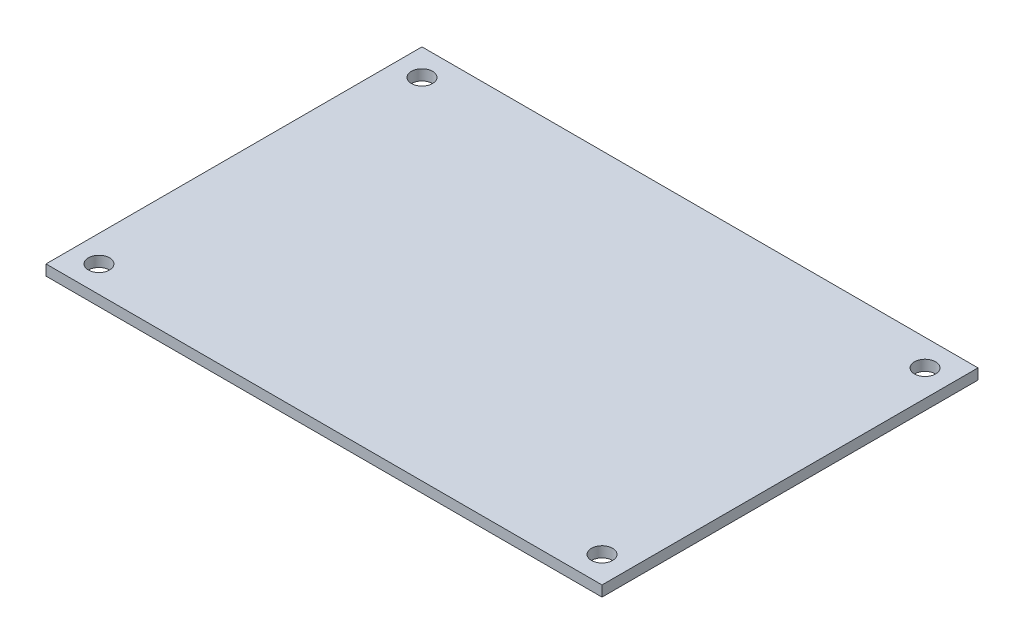
ISO-10303-21;
HEADER;
FILE_DESCRIPTION(('STEP AP214'),'2;1');
FILE_NAME('part.step','',(''),(''),'','','');
FILE_SCHEMA(('AUTOMOTIVE_DESIGN { 1 0 10303 214 1 1 1 1 }'));
ENDSEC;
DATA;
#1=APPLICATION_CONTEXT('core data for automotive mechanical design processes');
#2=APPLICATION_PROTOCOL_DEFINITION('international standard','automotive_design',2000,#1);
#3=PRODUCT_CONTEXT('',#1,'mechanical');
#4=PRODUCT('Part','Part','',(#3));
#5=PRODUCT_RELATED_PRODUCT_CATEGORY('part','',(#4));
#6=PRODUCT_DEFINITION_FORMATION('','',#4);
#7=PRODUCT_DEFINITION_CONTEXT('part definition',#1,'design');
#8=PRODUCT_DEFINITION('design','',#6,#7);
#9=PRODUCT_DEFINITION_SHAPE('','',#8);
#10=(LENGTH_UNIT() NAMED_UNIT(*) SI_UNIT(.MILLI.,.METRE.));
#11=(NAMED_UNIT(*) PLANE_ANGLE_UNIT() SI_UNIT($,.RADIAN.));
#12=(NAMED_UNIT(*) SI_UNIT($,.STERADIAN.) SOLID_ANGLE_UNIT());
#13=UNCERTAINTY_MEASURE_WITH_UNIT(LENGTH_MEASURE(1.E-05),#10,'distance_accuracy_value','');
#14=(GEOMETRIC_REPRESENTATION_CONTEXT(3) GLOBAL_UNCERTAINTY_ASSIGNED_CONTEXT((#13)) GLOBAL_UNIT_ASSIGNED_CONTEXT((#10,
#11,#12)) REPRESENTATION_CONTEXT('',''));
#15=CARTESIAN_POINT('',(0.,0.,0.));
#16=DIRECTION('',(0.,0.,1.));
#17=DIRECTION('',(1.,0.,0.));
#18=AXIS2_PLACEMENT_3D('',#15,#16,#17);
#19=CARTESIAN_POINT('',(0.,2.,0.));
#20=DIRECTION('',(0.,-1.,0.));
#21=DIRECTION('',(0.,0.,-1.));
#22=AXIS2_PLACEMENT_3D('',#19,#20,#21);
#23=PLANE('',#22);
#24=DIRECTION('',(0.,0.,-1.));
#25=VECTOR('',#24,1.);
#26=CARTESIAN_POINT('',(52.5,2.,35.5));
#27=LINE('',#26,#25);
#28=CARTESIAN_POINT('',(52.5,2.,35.5));
#29=VERTEX_POINT('',#28);
#30=CARTESIAN_POINT('',(52.5,2.,-35.5));
#31=VERTEX_POINT('',#30);
#32=EDGE_CURVE('E84',#29,#31,#27,.T.);
#33=ORIENTED_EDGE('',*,*,#32,.T.);
#34=DIRECTION('',(-1.,0.,0.));
#35=VECTOR('',#34,1.);
#36=CARTESIAN_POINT('',(-52.5,2.,-35.5));
#37=LINE('',#36,#35);
#38=CARTESIAN_POINT('',(-52.5,2.,-35.5));
#39=VERTEX_POINT('',#38);
#40=EDGE_CURVE('E79',#31,#39,#37,.T.);
#41=ORIENTED_EDGE('',*,*,#40,.T.);
#42=DIRECTION('',(0.,0.,1.));
#43=VECTOR('',#42,1.);
#44=CARTESIAN_POINT('',(-52.5,2.,35.5));
#45=LINE('',#44,#43);
#46=CARTESIAN_POINT('',(-52.5,2.,35.5));
#47=VERTEX_POINT('',#46);
#48=EDGE_CURVE('E82',#39,#47,#45,.T.);
#49=ORIENTED_EDGE('',*,*,#48,.T.);
#50=DIRECTION('',(1.,0.,0.));
#51=VECTOR('',#50,1.);
#52=CARTESIAN_POINT('',(-52.5,2.,35.5));
#53=LINE('',#52,#51);
#54=EDGE_CURVE('E49',#47,#29,#53,.T.);
#55=ORIENTED_EDGE('',*,*,#54,.T.);
#56=EDGE_LOOP('',(#33,#41,#49,#55));
#57=FACE_BOUND('',#56,.T.);
#58=CARTESIAN_POINT('',(-47.5,2.,-30.5));
#59=DIRECTION('',(0.,1.,0.));
#60=DIRECTION('',(0.,0.,1.));
#61=AXIS2_PLACEMENT_3D('',#58,#59,#60);
#62=CIRCLE('',#61,2.);
#63=CARTESIAN_POINT('',(-47.5,2.,-28.5));
#64=VERTEX_POINT('',#63);
#65=EDGE_CURVE('E99',#64,#64,#62,.T.);
#66=ORIENTED_EDGE('',*,*,#65,.F.);
#67=EDGE_LOOP('',(#66));
#68=FACE_BOUND('',#67,.T.);
#69=CARTESIAN_POINT('',(47.5,2.,-30.5));
#70=DIRECTION('',(0.,1.,0.));
#71=DIRECTION('',(0.,0.,1.));
#72=AXIS2_PLACEMENT_3D('',#69,#70,#71);
#73=CIRCLE('',#72,2.);
#74=CARTESIAN_POINT('',(47.5,2.,-28.5));
#75=VERTEX_POINT('',#74);
#76=EDGE_CURVE('E114',#75,#75,#73,.T.);
#77=ORIENTED_EDGE('',*,*,#76,.F.);
#78=EDGE_LOOP('',(#77));
#79=FACE_BOUND('',#78,.T.);
#80=CARTESIAN_POINT('',(47.5,2.,30.5));
#81=DIRECTION('',(0.,1.,0.));
#82=DIRECTION('',(0.,0.,1.));
#83=AXIS2_PLACEMENT_3D('',#80,#81,#82);
#84=CIRCLE('',#83,2.);
#85=CARTESIAN_POINT('',(47.5,2.,32.5));
#86=VERTEX_POINT('',#85);
#87=EDGE_CURVE('E120',#86,#86,#84,.T.);
#88=ORIENTED_EDGE('',*,*,#87,.F.);
#89=EDGE_LOOP('',(#88));
#90=FACE_BOUND('',#89,.T.);
#91=CARTESIAN_POINT('',(-47.5,2.,30.5));
#92=DIRECTION('',(0.,1.,0.));
#93=DIRECTION('',(0.,0.,1.));
#94=AXIS2_PLACEMENT_3D('',#91,#92,#93);
#95=CIRCLE('',#94,2.);
#96=CARTESIAN_POINT('',(-47.5,2.,32.5));
#97=VERTEX_POINT('',#96);
#98=EDGE_CURVE('E126',#97,#97,#95,.T.);
#99=ORIENTED_EDGE('',*,*,#98,.F.);
#100=EDGE_LOOP('',(#99));
#101=FACE_BOUND('',#100,.T.);
#102=ADVANCED_FACE('F32',(#57,#68,#79,#90,#101),#23,.F.);
#103=CARTESIAN_POINT('',(0.,0.,0.));
#104=DIRECTION('',(0.,-1.,0.));
#105=DIRECTION('',(0.,0.,-1.));
#106=AXIS2_PLACEMENT_3D('',#103,#104,#105);
#107=PLANE('',#106);
#108=CARTESIAN_POINT('',(47.5,0.,30.5));
#109=DIRECTION('',(0.,1.,0.));
#110=DIRECTION('',(0.,0.,1.));
#111=AXIS2_PLACEMENT_3D('',#108,#109,#110);
#112=CIRCLE('',#111,2.);
#113=CARTESIAN_POINT('',(47.5,0.,32.5));
#114=VERTEX_POINT('',#113);
#115=EDGE_CURVE('E123',#114,#114,#112,.T.);
#116=ORIENTED_EDGE('',*,*,#115,.T.);
#117=EDGE_LOOP('',(#116));
#118=FACE_BOUND('',#117,.T.);
#119=CARTESIAN_POINT('',(-47.5,0.,-30.5));
#120=DIRECTION('',(0.,1.,0.));
#121=DIRECTION('',(0.,0.,1.));
#122=AXIS2_PLACEMENT_3D('',#119,#120,#121);
#123=CIRCLE('',#122,2.);
#124=CARTESIAN_POINT('',(-47.5,0.,-28.5));
#125=VERTEX_POINT('',#124);
#126=EDGE_CURVE('E111',#125,#125,#123,.T.);
#127=ORIENTED_EDGE('',*,*,#126,.T.);
#128=EDGE_LOOP('',(#127));
#129=FACE_BOUND('',#128,.T.);
#130=DIRECTION('',(0.,0.,-1.));
#131=VECTOR('',#130,1.);
#132=CARTESIAN_POINT('',(52.5,0.,35.5));
#133=LINE('',#132,#131);
#134=CARTESIAN_POINT('',(52.5,0.,35.5));
#135=VERTEX_POINT('',#134);
#136=CARTESIAN_POINT('',(52.5,0.,-35.5));
#137=VERTEX_POINT('',#136);
#138=EDGE_CURVE('E96',#135,#137,#133,.T.);
#139=ORIENTED_EDGE('',*,*,#138,.F.);
#140=DIRECTION('',(1.,0.,0.));
#141=VECTOR('',#140,1.);
#142=CARTESIAN_POINT('',(-52.5,0.,35.5));
#143=LINE('',#142,#141);
#144=CARTESIAN_POINT('',(-52.5,0.,35.5));
#145=VERTEX_POINT('',#144);
#146=EDGE_CURVE('E72',#145,#135,#143,.T.);
#147=ORIENTED_EDGE('',*,*,#146,.F.);
#148=DIRECTION('',(0.,0.,1.));
#149=VECTOR('',#148,1.);
#150=CARTESIAN_POINT('',(-52.5,0.,35.5));
#151=LINE('',#150,#149);
#152=CARTESIAN_POINT('',(-52.5,0.,-35.5));
#153=VERTEX_POINT('',#152);
#154=EDGE_CURVE('E66',#153,#145,#151,.T.);
#155=ORIENTED_EDGE('',*,*,#154,.F.);
#156=DIRECTION('',(-1.,0.,0.));
#157=VECTOR('',#156,1.);
#158=CARTESIAN_POINT('',(-52.5,0.,-35.5));
#159=LINE('',#158,#157);
#160=EDGE_CURVE('E88',#137,#153,#159,.T.);
#161=ORIENTED_EDGE('',*,*,#160,.F.);
#162=EDGE_LOOP('',(#139,#147,#155,#161));
#163=FACE_BOUND('',#162,.T.);
#164=CARTESIAN_POINT('',(47.5,0.,-30.5));
#165=DIRECTION('',(0.,1.,0.));
#166=DIRECTION('',(0.,0.,1.));
#167=AXIS2_PLACEMENT_3D('',#164,#165,#166);
#168=CIRCLE('',#167,2.);
#169=CARTESIAN_POINT('',(47.5,0.,-28.5));
#170=VERTEX_POINT('',#169);
#171=EDGE_CURVE('E117',#170,#170,#168,.T.);
#172=ORIENTED_EDGE('',*,*,#171,.T.);
#173=EDGE_LOOP('',(#172));
#174=FACE_BOUND('',#173,.T.);
#175=CARTESIAN_POINT('',(-47.5,0.,30.5));
#176=DIRECTION('',(0.,1.,0.));
#177=DIRECTION('',(0.,0.,1.));
#178=AXIS2_PLACEMENT_3D('',#175,#176,#177);
#179=CIRCLE('',#178,2.);
#180=CARTESIAN_POINT('',(-47.5,0.,32.5));
#181=VERTEX_POINT('',#180);
#182=EDGE_CURVE('E129',#181,#181,#179,.T.);
#183=ORIENTED_EDGE('',*,*,#182,.T.);
#184=EDGE_LOOP('',(#183));
#185=FACE_BOUND('',#184,.T.);
#186=ADVANCED_FACE('F107',(#118,#129,#163,#174,#185),#107,.T.);
#187=CARTESIAN_POINT('',(52.5,2.,35.5));
#188=DIRECTION('',(-1.,0.,0.));
#189=DIRECTION('',(0.,0.,1.));
#190=AXIS2_PLACEMENT_3D('',#187,#188,#189);
#191=PLANE('',#190);
#192=ORIENTED_EDGE('',*,*,#138,.T.);
#193=DIRECTION('',(0.,-1.,0.));
#194=VECTOR('',#193,1.);
#195=CARTESIAN_POINT('',(52.5,2.,-35.5));
#196=LINE('',#195,#194);
#197=EDGE_CURVE('E11',#31,#137,#196,.T.);
#198=ORIENTED_EDGE('',*,*,#197,.F.);
#199=ORIENTED_EDGE('',*,*,#32,.F.);
#200=DIRECTION('',(0.,-1.,0.));
#201=VECTOR('',#200,1.);
#202=CARTESIAN_POINT('',(52.5,2.,35.5));
#203=LINE('',#202,#201);
#204=EDGE_CURVE('E92',#29,#135,#203,.T.);
#205=ORIENTED_EDGE('',*,*,#204,.T.);
#206=EDGE_LOOP('',(#192,#198,#199,#205));
#207=FACE_BOUND('',#206,.T.);
#208=ADVANCED_FACE('F34',(#207),#191,.F.);
#209=CARTESIAN_POINT('',(-52.5,2.,-35.5));
#210=DIRECTION('',(0.,0.,1.));
#211=DIRECTION('',(1.,0.,0.));
#212=AXIS2_PLACEMENT_3D('',#209,#210,#211);
#213=PLANE('',#212);
#214=ORIENTED_EDGE('',*,*,#160,.T.);
#215=DIRECTION('',(0.,-1.,0.));
#216=VECTOR('',#215,1.);
#217=CARTESIAN_POINT('',(-52.5,2.,-35.5));
#218=LINE('',#217,#216);
#219=EDGE_CURVE('E41',#39,#153,#218,.T.);
#220=ORIENTED_EDGE('',*,*,#219,.F.);
#221=ORIENTED_EDGE('',*,*,#40,.F.);
#222=ORIENTED_EDGE('',*,*,#197,.T.);
#223=EDGE_LOOP('',(#214,#220,#221,#222));
#224=FACE_BOUND('',#223,.T.);
#225=ADVANCED_FACE('F87',(#224),#213,.F.);
#226=CARTESIAN_POINT('',(-52.5,2.,35.5));
#227=DIRECTION('',(1.,0.,0.));
#228=DIRECTION('',(0.,0.,-1.));
#229=AXIS2_PLACEMENT_3D('',#226,#227,#228);
#230=PLANE('',#229);
#231=ORIENTED_EDGE('',*,*,#154,.T.);
#232=DIRECTION('',(0.,-1.,0.));
#233=VECTOR('',#232,1.);
#234=CARTESIAN_POINT('',(-52.5,2.,35.5));
#235=LINE('',#234,#233);
#236=EDGE_CURVE('E89',#47,#145,#235,.T.);
#237=ORIENTED_EDGE('',*,*,#236,.F.);
#238=ORIENTED_EDGE('',*,*,#48,.F.);
#239=ORIENTED_EDGE('',*,*,#219,.T.);
#240=EDGE_LOOP('',(#231,#237,#238,#239));
#241=FACE_BOUND('',#240,.T.);
#242=ADVANCED_FACE('F90',(#241),#230,.F.);
#243=CARTESIAN_POINT('',(-52.5,2.,35.5));
#244=DIRECTION('',(0.,0.,-1.));
#245=DIRECTION('',(-1.,0.,0.));
#246=AXIS2_PLACEMENT_3D('',#243,#244,#245);
#247=PLANE('',#246);
#248=ORIENTED_EDGE('',*,*,#146,.T.);
#249=ORIENTED_EDGE('',*,*,#204,.F.);
#250=ORIENTED_EDGE('',*,*,#54,.F.);
#251=ORIENTED_EDGE('',*,*,#236,.T.);
#252=EDGE_LOOP('',(#248,#249,#250,#251));
#253=FACE_BOUND('',#252,.T.);
#254=ADVANCED_FACE('F104',(#253),#247,.F.);
#255=CARTESIAN_POINT('',(-47.5,2.,-30.5));
#256=DIRECTION('',(0.,-1.,0.));
#257=DIRECTION('',(0.,0.,-1.));
#258=AXIS2_PLACEMENT_3D('',#255,#256,#257);
#259=CYLINDRICAL_SURFACE('',#258,2.);
#260=ORIENTED_EDGE('',*,*,#65,.T.);
#261=EDGE_LOOP('',(#260));
#262=FACE_BOUND('',#261,.T.);
#263=ORIENTED_EDGE('',*,*,#126,.F.);
#264=EDGE_LOOP('',(#263));
#265=FACE_BOUND('',#264,.T.);
#266=ADVANCED_FACE('F146',(#262,#265),#259,.F.);
#267=CARTESIAN_POINT('',(47.5,2.,-30.5));
#268=DIRECTION('',(0.,-1.,0.));
#269=DIRECTION('',(0.,0.,-1.));
#270=AXIS2_PLACEMENT_3D('',#267,#268,#269);
#271=CYLINDRICAL_SURFACE('',#270,2.);
#272=ORIENTED_EDGE('',*,*,#76,.T.);
#273=EDGE_LOOP('',(#272));
#274=FACE_BOUND('',#273,.T.);
#275=ORIENTED_EDGE('',*,*,#171,.F.);
#276=EDGE_LOOP('',(#275));
#277=FACE_BOUND('',#276,.T.);
#278=ADVANCED_FACE('F192',(#274,#277),#271,.F.);
#279=CARTESIAN_POINT('',(47.5,2.,30.5));
#280=DIRECTION('',(0.,-1.,0.));
#281=DIRECTION('',(0.,0.,-1.));
#282=AXIS2_PLACEMENT_3D('',#279,#280,#281);
#283=CYLINDRICAL_SURFACE('',#282,2.);
#284=ORIENTED_EDGE('',*,*,#87,.T.);
#285=EDGE_LOOP('',(#284));
#286=FACE_BOUND('',#285,.T.);
#287=ORIENTED_EDGE('',*,*,#115,.F.);
#288=EDGE_LOOP('',(#287));
#289=FACE_BOUND('',#288,.T.);
#290=ADVANCED_FACE('F200',(#286,#289),#283,.F.);
#291=CARTESIAN_POINT('',(-47.5,2.,30.5));
#292=DIRECTION('',(0.,-1.,0.));
#293=DIRECTION('',(0.,0.,-1.));
#294=AXIS2_PLACEMENT_3D('',#291,#292,#293);
#295=CYLINDRICAL_SURFACE('',#294,2.);
#296=ORIENTED_EDGE('',*,*,#98,.T.);
#297=EDGE_LOOP('',(#296));
#298=FACE_BOUND('',#297,.T.);
#299=ORIENTED_EDGE('',*,*,#182,.F.);
#300=EDGE_LOOP('',(#299));
#301=FACE_BOUND('',#300,.T.);
#302=ADVANCED_FACE('F135',(#298,#301),#295,.F.);
#303=CLOSED_SHELL('',(#102,#186,#208,#225,#242,#254,#266,#278,#290,#302));
#304=MANIFOLD_SOLID_BREP('B2',#303);
#305=ADVANCED_BREP_SHAPE_REPRESENTATION('',(#18,#304),#14);
#306=SHAPE_DEFINITION_REPRESENTATION(#9,#305);
ENDSEC;
END-ISO-10303-21;
